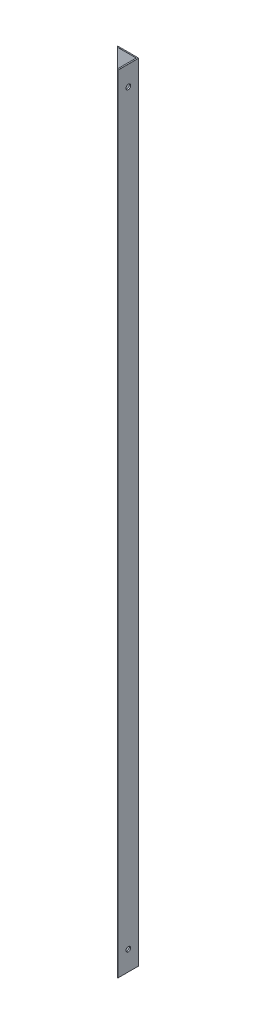
ISO-10303-21;
HEADER;
FILE_DESCRIPTION(('STEP AP214'),'2;1');
FILE_NAME('part.step','',(''),(''),'','','');
FILE_SCHEMA(('AUTOMOTIVE_DESIGN { 1 0 10303 214 1 1 1 1 }'));
ENDSEC;
DATA;
#1=APPLICATION_CONTEXT('core data for automotive mechanical design processes');
#2=APPLICATION_PROTOCOL_DEFINITION('international standard','automotive_design',2000,#1);
#3=PRODUCT_CONTEXT('',#1,'mechanical');
#4=PRODUCT('Part','Part','',(#3));
#5=PRODUCT_RELATED_PRODUCT_CATEGORY('part','',(#4));
#6=PRODUCT_DEFINITION_FORMATION('','',#4);
#7=PRODUCT_DEFINITION_CONTEXT('part definition',#1,'design');
#8=PRODUCT_DEFINITION('design','',#6,#7);
#9=PRODUCT_DEFINITION_SHAPE('','',#8);
#10=(LENGTH_UNIT() NAMED_UNIT(*) SI_UNIT(.MILLI.,.METRE.));
#11=(NAMED_UNIT(*) PLANE_ANGLE_UNIT() SI_UNIT($,.RADIAN.));
#12=(NAMED_UNIT(*) SI_UNIT($,.STERADIAN.) SOLID_ANGLE_UNIT());
#13=UNCERTAINTY_MEASURE_WITH_UNIT(LENGTH_MEASURE(1.E-05),#10,'distance_accuracy_value','');
#14=(GEOMETRIC_REPRESENTATION_CONTEXT(3) GLOBAL_UNCERTAINTY_ASSIGNED_CONTEXT((#13)) GLOBAL_UNIT_ASSIGNED_CONTEXT((#10,
#11,#12)) REPRESENTATION_CONTEXT('',''));
#15=CARTESIAN_POINT('',(0.,0.,0.));
#16=DIRECTION('',(0.,0.,1.));
#17=DIRECTION('',(1.,0.,0.));
#18=AXIS2_PLACEMENT_3D('',#15,#16,#17);
#19=CARTESIAN_POINT('',(23.6850662103019,2000.,46.5553915714054));
#20=DIRECTION('',(0.,-1.,0.));
#21=DIRECTION('',(0.,0.,-1.));
#22=AXIS2_PLACEMENT_3D('',#19,#20,#21);
#23=CYLINDRICAL_SURFACE('',#22,3.44460842859456);
#24=DIRECTION('',(0.,-1.,0.));
#25=VECTOR('',#24,1.);
#26=CARTESIAN_POINT('',(20.2404577817074,2000.,46.5553915714054));
#27=LINE('',#26,#25);
#28=CARTESIAN_POINT('',(20.2404577817074,1999.9,46.5553915714054));
#29=VERTEX_POINT('',#28);
#30=CARTESIAN_POINT('',(20.2404577817074,0.099999999999989,46.5553915714054));
#31=VERTEX_POINT('',#30);
#32=EDGE_CURVE('E277',#29,#31,#27,.T.);
#33=ORIENTED_EDGE('',*,*,#32,.T.);
#34=CARTESIAN_POINT('',(23.6850662103019,0.099999999999989,46.5553915714054));
#35=DIRECTION('',(0.,1.,0.));
#36=DIRECTION('',(0.,0.,1.));
#37=AXIS2_PLACEMENT_3D('',#34,#35,#36);
#38=CIRCLE('',#37,3.44460842859456);
#39=CARTESIAN_POINT('',(23.6850662103019,0.100000000000211,50.));
#40=VERTEX_POINT('',#39);
#41=EDGE_CURVE('E152',#31,#40,#38,.T.);
#42=ORIENTED_EDGE('',*,*,#41,.T.);
#43=DIRECTION('',(0.,-1.,0.));
#44=VECTOR('',#43,1.);
#45=CARTESIAN_POINT('',(23.6850662103019,2000.,50.));
#46=LINE('',#45,#44);
#47=CARTESIAN_POINT('',(23.6850662103019,1999.9,50.));
#48=VERTEX_POINT('',#47);
#49=EDGE_CURVE('E290',#48,#40,#46,.T.);
#50=ORIENTED_EDGE('',*,*,#49,.F.);
#51=CARTESIAN_POINT('',(23.6850662103019,1999.9,46.5553915714054));
#52=DIRECTION('',(0.,1.,0.));
#53=DIRECTION('',(0.,0.,1.));
#54=AXIS2_PLACEMENT_3D('',#51,#52,#53);
#55=CIRCLE('',#54,3.44460842859456);
#56=EDGE_CURVE('E148',#48,#29,#55,.F.);
#57=ORIENTED_EDGE('',*,*,#56,.T.);
#58=EDGE_LOOP('',(#33,#42,#50,#57));
#59=FACE_BOUND('',#58,.T.);
#60=ADVANCED_FACE('F35',(#59),#23,.T.);
#61=CARTESIAN_POINT('',(23.6850662103019,2000.,11.4167963099841));
#62=DIRECTION('',(-1.,0.,0.));
#63=DIRECTION('',(0.,0.,1.));
#64=AXIS2_PLACEMENT_3D('',#61,#62,#63);
#65=PLANE('',#64);
#66=CARTESIAN_POINT('',(23.6850662103019,1949.9,23.5));
#67=DIRECTION('',(1.,0.,0.));
#68=DIRECTION('',(0.,0.,-1.));
#69=AXIS2_PLACEMENT_3D('',#66,#67,#68);
#70=CIRCLE('',#69,6.);
#71=CARTESIAN_POINT('',(23.6850662103019,1949.9,17.5));
#72=VERTEX_POINT('',#71);
#73=EDGE_CURVE('E258',#72,#72,#70,.T.);
#74=ORIENTED_EDGE('',*,*,#73,.F.);
#75=EDGE_LOOP('',(#74));
#76=FACE_BOUND('',#75,.T.);
#77=CARTESIAN_POINT('',(23.6850662103019,50.1000000000002,23.4999999999998));
#78=DIRECTION('',(1.,0.,0.));
#79=DIRECTION('',(0.,0.,-1.));
#80=AXIS2_PLACEMENT_3D('',#77,#78,#79);
#81=CIRCLE('',#80,6.);
#82=CARTESIAN_POINT('',(23.6850662103019,50.1000000000002,17.4999999999998));
#83=VERTEX_POINT('',#82);
#84=EDGE_CURVE('E255',#83,#83,#81,.T.);
#85=ORIENTED_EDGE('',*,*,#84,.F.);
#86=EDGE_LOOP('',(#85));
#87=FACE_BOUND('',#86,.T.);
#88=ORIENTED_EDGE('',*,*,#49,.T.);
#89=DIRECTION('',(0.,0.,-1.));
#90=VECTOR('',#89,1.);
#91=CARTESIAN_POINT('',(23.6850662103019,0.099999999999989,11.4167963099841));
#92=LINE('',#91,#90);
#93=CARTESIAN_POINT('',(23.6850662103019,0.100000000000211,-3.00000000000001));
#94=VERTEX_POINT('',#93);
#95=EDGE_CURVE('E175',#40,#94,#92,.T.);
#96=ORIENTED_EDGE('',*,*,#95,.T.);
#97=DIRECTION('',(0.,-1.,0.));
#98=VECTOR('',#97,1.);
#99=CARTESIAN_POINT('',(23.6850662103019,2000.,-3.00000000000001));
#100=LINE('',#99,#98);
#101=CARTESIAN_POINT('',(23.6850662103019,1999.9,-3.00000000000001));
#102=VERTEX_POINT('',#101);
#103=EDGE_CURVE('E287',#102,#94,#100,.T.);
#104=ORIENTED_EDGE('',*,*,#103,.F.);
#105=DIRECTION('',(0.,0.,-1.));
#106=VECTOR('',#105,1.);
#107=CARTESIAN_POINT('',(23.6850662103019,1999.9,50.));
#108=LINE('',#107,#106);
#109=EDGE_CURVE('E173',#102,#48,#108,.F.);
#110=ORIENTED_EDGE('',*,*,#109,.T.);
#111=EDGE_LOOP('',(#88,#96,#104,#110));
#112=FACE_BOUND('',#111,.T.);
#113=ADVANCED_FACE('F328',(#76,#87,#112),#65,.F.);
#114=CARTESIAN_POINT('',(-61.9284113845546,2000.,-3.));
#115=DIRECTION('',(0.,0.,1.));
#116=DIRECTION('',(1.,0.,0.));
#117=AXIS2_PLACEMENT_3D('',#114,#115,#116);
#118=PLANE('',#117);
#119=CARTESIAN_POINT('',(0.,1950.,-3.));
#120=DIRECTION('',(0.,0.,-1.));
#121=DIRECTION('',(-1.,0.,0.));
#122=AXIS2_PLACEMENT_3D('',#119,#120,#121);
#123=CIRCLE('',#122,6.);
#124=CARTESIAN_POINT('',(-6.,1950.,-3.));
#125=VERTEX_POINT('',#124);
#126=EDGE_CURVE('E271',#125,#125,#123,.T.);
#127=ORIENTED_EDGE('',*,*,#126,.F.);
#128=EDGE_LOOP('',(#127));
#129=FACE_BOUND('',#128,.T.);
#130=CARTESIAN_POINT('',(0.,50.,-3.));
#131=DIRECTION('',(0.,0.,-1.));
#132=DIRECTION('',(-1.,0.,0.));
#133=AXIS2_PLACEMENT_3D('',#130,#131,#132);
#134=CIRCLE('',#133,6.);
#135=CARTESIAN_POINT('',(-6.,50.,-3.));
#136=VERTEX_POINT('',#135);
#137=EDGE_CURVE('E261',#136,#136,#134,.T.);
#138=ORIENTED_EDGE('',*,*,#137,.F.);
#139=EDGE_LOOP('',(#138));
#140=FACE_BOUND('',#139,.T.);
#141=ORIENTED_EDGE('',*,*,#103,.T.);
#142=DIRECTION('',(-1.,0.,0.));
#143=VECTOR('',#142,1.);
#144=CARTESIAN_POINT('',(-61.9284113845546,0.099999999999989,-3.));
#145=LINE('',#144,#143);
#146=CARTESIAN_POINT('',(-29.7595422182926,0.099999999999989,-3.));
#147=VERTEX_POINT('',#146);
#148=EDGE_CURVE('E179',#94,#147,#145,.T.);
#149=ORIENTED_EDGE('',*,*,#148,.T.);
#150=DIRECTION('',(0.,-1.,0.));
#151=VECTOR('',#150,1.);
#152=CARTESIAN_POINT('',(-29.7595422182926,2000.,-3.));
#153=LINE('',#152,#151);
#154=CARTESIAN_POINT('',(-29.7595422182926,1999.9,-3.));
#155=VERTEX_POINT('',#154);
#156=EDGE_CURVE('E131',#155,#147,#153,.T.);
#157=ORIENTED_EDGE('',*,*,#156,.F.);
#158=DIRECTION('',(-1.,0.,0.));
#159=VECTOR('',#158,1.);
#160=CARTESIAN_POINT('',(23.6850662103019,1999.9,-3.00000000000001));
#161=LINE('',#160,#159);
#162=EDGE_CURVE('E177',#155,#102,#161,.F.);
#163=ORIENTED_EDGE('',*,*,#162,.T.);
#164=EDGE_LOOP('',(#141,#149,#157,#163));
#165=FACE_BOUND('',#164,.T.);
#166=ADVANCED_FACE('F200',(#129,#140,#165),#118,.F.);
#167=CARTESIAN_POINT('',(-26.7507357630917,2000.,-3.));
#168=DIRECTION('',(0.,-1.,0.));
#169=DIRECTION('',(0.,0.,-1.));
#170=AXIS2_PLACEMENT_3D('',#167,#168,#169);
#171=CYLINDRICAL_SURFACE('',#170,3.00880645520094);
#172=ORIENTED_EDGE('',*,*,#156,.T.);
#173=CARTESIAN_POINT('',(-29.7595422182926,0.099999999999989,-3.));
#174=CARTESIAN_POINT('',(-29.7595417690738,0.0943742322855582,-3.00000477807954));
#175=CARTESIAN_POINT('',(-29.759542211009,0.0887498913895016,-2.99952554683466));
#176=CARTESIAN_POINT('',(-29.7595415556206,0.0776645970708112,-2.99763432190128));
#177=CARTESIAN_POINT('',(-29.7595404595007,0.0722035193008721,-2.99622305803308));
#178=CARTESIAN_POINT('',(-29.7595334144243,0.061593445610054,-2.99250202831795));
#179=CARTESIAN_POINT('',(-29.7595274631337,0.0564446010693474,-2.99019183060305));
#180=CARTESIAN_POINT('',(-29.7595047610167,0.0466086732196983,-2.98474053455914));
#181=CARTESIAN_POINT('',(-29.7594880120904,0.041921508837429,-2.98159958247301));
#182=CARTESIAN_POINT('',(-29.7594368398036,0.0331412901402215,-2.9745756261875));
#183=CARTESIAN_POINT('',(-29.7594024174324,0.0290482025858148,-2.97069266353288));
#184=CARTESIAN_POINT('',(-29.7593088708123,0.0215712651807125,-2.96229401470441));
#185=CARTESIAN_POINT('',(-29.7592497418476,0.0181875509162628,-2.95777820784642));
#186=CARTESIAN_POINT('',(-29.7591008110204,0.012226495869483,-2.94824350913846));
#187=CARTESIAN_POINT('',(-29.759011009154,0.00964915518607266,-2.94322461722679));
#188=CARTESIAN_POINT('',(-29.7587967740408,0.00537479325981419,-2.93282707832559));
#189=CARTESIAN_POINT('',(-29.7586723608775,0.00367726312827122,-2.9274486413367));
#190=CARTESIAN_POINT('',(-29.758436707348,0.00163115109063416,-2.9183645149583));
#191=CARTESIAN_POINT('',(-29.7583355046517,0.00101980258944746,-2.91471557576013));
#192=CARTESIAN_POINT('',(-29.7581185243371,0.000204279045641968,-2.9073781848153));
#193=CARTESIAN_POINT('',(-29.7580027676939,-4.74984724881859E-07,-2.9036897967845));
#194=CARTESIAN_POINT('',(-29.757879970618,-4.76053352209366E-13,-2.90000000000011));
#195=B_SPLINE_CURVE_WITH_KNOTS('',3,(#173,#174,#175,#176,#177,#178,#179,#180,#181,#182,#183,
#184,#185,#186,#187,#188,#189,#190,#191,#192,#193,#194),.UNSPECIFIED.,.F.,.F.,(4,2,2,2,2,2,2,2,
2,2,4),(0.,0.0168548839564319,0.0336965854615551,0.0505463881075804,0.0673932265496339,
0.0842391220227314,0.101088234410699,0.117937348865586,0.134776706765806,0.145859134003079,
0.156925768590492),.UNSPECIFIED.);
#196=CARTESIAN_POINT('',(-29.757879970618,0.,-2.9));
#197=VERTEX_POINT('',#196);
#198=EDGE_CURVE('E126',#147,#197,#195,.T.);
#199=ORIENTED_EDGE('',*,*,#198,.T.);
#200=CARTESIAN_POINT('',(-26.7507357630917,0.,-3.));
#201=DIRECTION('',(0.,1.,0.));
#202=DIRECTION('',(0.,0.,1.));
#203=AXIS2_PLACEMENT_3D('',#200,#201,#202);
#204=CIRCLE('',#203,3.00880645520094);
#205=CARTESIAN_POINT('',(-27.5525563694987,0.,-0.0999999999999994));
#206=VERTEX_POINT('',#205);
#207=EDGE_CURVE('E129',#197,#206,#204,.T.);
#208=ORIENTED_EDGE('',*,*,#207,.T.);
#209=CARTESIAN_POINT('',(-27.5525563694987,0.,-0.1));
#210=CARTESIAN_POINT('',(-27.5203076627853,4.82061141471723E-05,-0.0910822895298904));
#211=CARTESIAN_POINT('',(-27.4879383642966,0.0011858197783805,-0.0827127946192675));
#212=CARTESIAN_POINT('',(-27.4230643875657,0.00521780892858665,-0.0670832032178255));
#213=CARTESIAN_POINT('',(-27.3905598327654,0.00811083096054839,-0.0598222574070298));
#214=CARTESIAN_POINT('',(-27.3161788572188,0.0162497432691016,-0.0444940294537487));
#215=CARTESIAN_POINT('',(-27.2742764992136,0.0219315875372554,-0.0367884801402077));
#216=CARTESIAN_POINT('',(-27.2039588403571,0.033109375539979,-0.0253850044914544));
#217=CARTESIAN_POINT('',(-27.1755374898798,0.0380780771372102,-0.0211950141097183));
#218=CARTESIAN_POINT('',(-27.1280423677989,0.0473182943384211,-0.0148822389866128));
#219=CARTESIAN_POINT('',(-27.1089413111005,0.0512891722494254,-0.0125308057560604));
#220=CARTESIAN_POINT('',(-27.0771094487125,0.0585858888820321,-0.00891954509728447));
#221=CARTESIAN_POINT('',(-27.064342378261,0.061696667370561,-0.00755451656795268));
#222=CARTESIAN_POINT('',(-27.043110276712,0.0674301696063135,-0.00542038940227326));
#223=CARTESIAN_POINT('',(-27.0346045295302,0.0698795184300798,-0.00460244742618608));
#224=CARTESIAN_POINT('',(-27.0204872950642,0.0744327117638685,-0.00330465387558594));
#225=CARTESIAN_POINT('',(-27.0148326806984,0.0763905645089115,-0.00280125104263516));
#226=CARTESIAN_POINT('',(-27.0054763666386,0.0800693782239627,-0.0019943354412549));
#227=CARTESIAN_POINT('',(-27.0017281682564,0.0816660256676913,-0.00167836238329875));
#228=CARTESIAN_POINT('',(-26.995552020851,0.0847019113390952,-0.00116895798130572));
#229=CARTESIAN_POINT('',(-26.9930761122526,0.0860355848536224,-0.000967985333301237));
#230=CARTESIAN_POINT('',(-26.9894540928618,0.0883462711942806,-0.000678167068089319));
#231=CARTESIAN_POINT('',(-26.9882290628561,0.0891970642298744,-0.000580951763594698));
#232=CARTESIAN_POINT('',(-26.9858954996035,0.0910477470256331,-0.000397107331810574));
#233=CARTESIAN_POINT('',(-26.9847864483644,0.0920469209490527,-0.000310430825599701));
#234=CARTESIAN_POINT('',(-26.9834085791875,0.0936101828216562,-0.000203371666077902));
#235=CARTESIAN_POINT('',(-26.9830331889205,0.0940782611395039,-0.00017428627737595));
#236=CARTESIAN_POINT('',(-26.9823434814029,0.0950584744830558,-0.000120957930055414));
#237=CARTESIAN_POINT('',(-26.9820291188971,0.0955705764531575,-9.67113828047918E-05));
#238=CARTESIAN_POINT('',(-26.9815391132133,0.0965388487302593,-5.89759626820503E-05));
#239=CARTESIAN_POINT('',(-26.9813484776558,0.0969872711438747,-4.43196984261674E-05));
#240=CARTESIAN_POINT('',(-26.9810424904108,0.0979089073561162,-2.08133593743876E-05));
#241=CARTESIAN_POINT('',(-26.9809269113784,0.0983820415543215,-1.1945750415102E-05));
#242=CARTESIAN_POINT('',(-26.9808277077937,0.0990496861596022,-4.33625859717711E-06));
#243=CARTESIAN_POINT('',(-26.9808065717659,0.0992389983955378,-2.7153151412495E-06));
#244=CARTESIAN_POINT('',(-26.9807782835699,0.0996188411405958,-5.46037763313421E-07));
#245=CARTESIAN_POINT('',(-26.9807711441305,0.099809372600704,1.31981672983211E-09));
#246=CARTESIAN_POINT('',(-26.9807711622346,0.0999999999999887,0.));
#247=B_SPLINE_CURVE_WITH_KNOTS('',3,(#209,#210,#211,#212,#213,#214,#215,#216,#217,#218,#219,
#220,#221,#222,#223,#224,#225,#226,#227,#228,#229,#230,#231,#232,#233,#234,#235,#236,#237,#238,
#239,#240,#241,#242,#243,#244,#245,#246),.UNSPECIFIED.,.F.,.F.,(4,2,2,2,2,2,2,2,2,2,2,2,2,2,2,2,
2,2,4),(0.,0.100312587741493,0.200547930630939,0.329403475384653,0.416842333507329,
0.475780712408881,0.515404449881789,0.542062609523358,0.560066107744915,0.572314961980908,
0.580753108945507,0.58523246800094,0.589690879922282,0.591489730785395,0.593287242567355,
0.594744682930938,0.596197687884476,0.596768733618089,0.597340298432562),.UNSPECIFIED.);
#248=CARTESIAN_POINT('',(-26.9807711622346,0.099999999999989,0.));
#249=VERTEX_POINT('',#248);
#250=EDGE_CURVE('E53',#206,#249,#247,.T.);
#251=ORIENTED_EDGE('',*,*,#250,.T.);
#252=DIRECTION('',(0.,-1.,0.));
#253=VECTOR('',#252,1.);
#254=CARTESIAN_POINT('',(-26.9807711622346,2000.,0.));
#255=LINE('',#254,#253);
#256=CARTESIAN_POINT('',(-26.9807711622346,1999.9,0.));
#257=VERTEX_POINT('',#256);
#258=EDGE_CURVE('E284',#257,#249,#255,.T.);
#259=ORIENTED_EDGE('',*,*,#258,.F.);
#260=CARTESIAN_POINT('',(-26.9807711622346,1999.9,0.));
#261=CARTESIAN_POINT('',(-26.980769718853,1999.90047411996,1.07706010250674E-07));
#262=CARTESIAN_POINT('',(-26.9808150759493,1999.900946214,-3.36707263194134E-06));
#263=CARTESIAN_POINT('',(-26.9809856270672,1999.90186925778,-1.64506023731021E-05));
#264=CARTESIAN_POINT('',(-26.9811097156725,1999.90232040891,-2.59744248195875E-05));
#265=CARTESIAN_POINT('',(-26.9814773038131,1999.90334489798,-5.42225704590842E-05));
#266=CARTESIAN_POINT('',(-26.981746864124,1999.90390861751,-7.49590034163623E-05));
#267=CARTESIAN_POINT('',(-26.9823708196168,1999.90498930504,-0.000123071566116954));
#268=CARTESIAN_POINT('',(-26.9827257490514,1999.90550594919,-0.000150489524663362));
#269=CARTESIAN_POINT('',(-26.9838283728161,1999.90692810606,-0.000235904504029261));
#270=CARTESIAN_POINT('',(-26.9846474095329,1999.90777700715,-0.000299621819820901));
#271=CARTESIAN_POINT('',(-26.9863875922367,1999.90935875731,-0.000435816415633031));
#272=CARTESIAN_POINT('',(-26.9873089852085,1999.91009131483,-0.000508314924379571));
#273=CARTESIAN_POINT('',(-26.9917419728463,1999.91334007023,-0.000859413245184962));
#274=CARTESIAN_POINT('',(-26.995584963336,1999.91538171858,-0.00117023157579726));
#275=CARTESIAN_POINT('',(-27.0034442263455,1999.91908500171,-0.0018220545138436));
#276=CARTESIAN_POINT('',(-27.0074615639862,1999.92074373624,-0.00216326400316481));
#277=CARTESIAN_POINT('',(-27.0195300753792,1999.92534888881,-0.00321341182106582));
#278=CARTESIAN_POINT('',(-27.0277034181014,1999.92797814644,-0.00395716252718484));
#279=CARTESIAN_POINT('',(-27.0441533068312,1999.93286801619,-0.00552317162270239));
#280=CARTESIAN_POINT('',(-27.0524300042635,1999.93512799603,-0.00634556092300244));
#281=CARTESIAN_POINT('',(-27.0772788865334,1999.94154478313,-0.00891961372371039));
#282=CARTESIAN_POINT('',(-27.0939296201248,1999.94535744005,-0.0107833343155886));
#283=CARTESIAN_POINT('',(-27.1475284830615,1999.95686207189,-0.0172403461491833));
#284=CARTESIAN_POINT('',(-27.1845959835226,1999.9636493008,-0.022402207861905));
#285=CARTESIAN_POINT('',(-27.2587743168544,1999.97572305822,-0.0341567145451804));
#286=CARTESIAN_POINT('',(-27.2958851602234,1999.98100834219,-0.040750538134858));
#287=CARTESIAN_POINT('',(-27.3697268431524,1999.98986478272,-0.0553149938209546));
#288=CARTESIAN_POINT('',(-27.4064582793594,1999.99344980808,-0.0632737390058482));
#289=CARTESIAN_POINT('',(-27.4613952290086,1999.99724609407,-0.0762638207480191));
#290=CARTESIAN_POINT('',(-27.4796724552924,1999.9982478827,-0.0807668572403908));
#291=CARTESIAN_POINT('',(-27.5161660262791,1999.99962218123,-0.0901223578962783));
#292=CARTESIAN_POINT('',(-27.5343823519674,1999.99999451012,-0.0949749221491903));
#293=CARTESIAN_POINT('',(-27.5525563694986,2000.,-0.0999999999999916));
#294=B_SPLINE_CURVE_WITH_KNOTS('',3,(#260,#261,#262,#263,#264,#265,#266,#267,#268,#269,#270,
#271,#272,#273,#274,#275,#276,#277,#278,#279,#280,#281,#282,#283,#284,#285,#286,#287,#288,#289,
#290,#291,#292,#293),.UNSPECIFIED.,.F.,.F.,(4,2,2,2,2,2,2,2,2,2,2,2,2,2,2,2,4),(0.,
0.0014169191978107,0.00281437177372994,0.00467935382490117,0.00655632563251038,
0.0100804293086168,0.0136132293200908,0.0266026849372312,0.039687513646267,0.0655018868828782,
0.0913600077339763,0.142887748523618,0.256923757839524,0.371053986072941,0.48423653776485,
0.540775705079696,0.597331127591749),.UNSPECIFIED.);
#295=CARTESIAN_POINT('',(-27.5525563694987,2000.,-0.0999999999999994));
#296=VERTEX_POINT('',#295);
#297=EDGE_CURVE('E181',#257,#296,#294,.T.);
#298=ORIENTED_EDGE('',*,*,#297,.T.);
#299=CARTESIAN_POINT('',(-26.7507357630917,2000.,-3.));
#300=DIRECTION('',(0.,1.,0.));
#301=DIRECTION('',(0.,0.,1.));
#302=AXIS2_PLACEMENT_3D('',#299,#300,#301);
#303=CIRCLE('',#302,3.00880645520094);
#304=CARTESIAN_POINT('',(-29.757879970618,2000.,-2.9));
#305=VERTEX_POINT('',#304);
#306=EDGE_CURVE('E142',#305,#296,#303,.T.);
#307=ORIENTED_EDGE('',*,*,#306,.F.);
#308=CARTESIAN_POINT('',(-29.757879970618,2000.,-2.9));
#309=CARTESIAN_POINT('',(-29.758067546618,2000.00000479851,-2.90562238458636));
#310=CARTESIAN_POINT('',(-29.7582381107428,1999.99952611484,-2.9112439731164));
#311=CARTESIAN_POINT('',(-29.7585443660695,1999.9976365815,-2.9223249350217));
#312=CARTESIAN_POINT('',(-29.7586800842176,1999.99622645515,-2.92778443083567));
#313=CARTESIAN_POINT('',(-29.758916150409,1999.99250781036,-2.93839243143987));
#314=CARTESIAN_POINT('',(-29.7590164808049,1999.99019884489,-2.94354078000837));
#315=CARTESIAN_POINT('',(-29.7591849766835,1999.98474990615,-2.95337637284387));
#316=CARTESIAN_POINT('',(-29.7592531480078,1999.98161008398,-2.95806370073204));
#317=CARTESIAN_POINT('',(-29.7593627366915,1999.97458901143,-2.96684363528814));
#318=CARTESIAN_POINT('',(-29.7594041620511,1999.97070798323,-2.97093641951363));
#319=CARTESIAN_POINT('',(-29.7594671104075,1999.96231309933,-2.97841347701758));
#320=CARTESIAN_POINT('',(-29.759488629466,1999.95779911862,-2.98179760999899));
#321=CARTESIAN_POINT('',(-29.7595188100709,1999.94826613169,-2.9877611193224));
#322=CARTESIAN_POINT('',(-29.7595274674775,1999.94324696342,-2.99034023635088));
#323=CARTESIAN_POINT('',(-29.7595381699015,1999.93284790167,-2.99461806044434));
#324=CARTESIAN_POINT('',(-29.7595402187778,1999.92746822057,-2.99631728082549));
#325=CARTESIAN_POINT('',(-29.7595418841662,1999.91837985557,-2.99836608050016));
#326=CARTESIAN_POINT('',(-29.7595420925527,1999.91472824005,-2.99897842578769));
#327=CARTESIAN_POINT('',(-29.7595422191827,1999.90738492587,-2.99979533473241));
#328=CARTESIAN_POINT('',(-29.7595421378366,1999.90369329129,-3.00000047457001));
#329=CARTESIAN_POINT('',(-29.759542218293,1999.9,-3.00000000000048));
#330=B_SPLINE_CURVE_WITH_KNOTS('',3,(#308,#309,#310,#311,#312,#313,#314,#315,#316,#317,#318,
#319,#320,#321,#322,#323,#324,#325,#326,#327,#328,#329),.UNSPECIFIED.,.F.,.F.,(4,2,2,2,2,2,2,2,
2,2,4),(0.,0.0168542318005121,0.0336953907628248,0.0505449363143928,0.0673914199920905,
0.0842328621609756,0.101077635412162,0.117927829152834,0.134768181682093,0.145854836284214,
0.156925792472826),.UNSPECIFIED.);
#331=EDGE_CURVE('E187',#305,#155,#330,.T.);
#332=ORIENTED_EDGE('',*,*,#331,.T.);
#333=EDGE_LOOP('',(#172,#199,#208,#251,#259,#298,#307,#332));
#334=FACE_BOUND('',#333,.T.);
#335=ADVANCED_FACE('F128',(#334),#171,.T.);
#336=CARTESIAN_POINT('',(-61.9284113845546,2000.,0.));
#337=DIRECTION('',(0.,0.,-1.));
#338=DIRECTION('',(-1.,0.,0.));
#339=AXIS2_PLACEMENT_3D('',#336,#337,#338);
#340=PLANE('',#339);
#341=CARTESIAN_POINT('',(0.,1950.,0.));
#342=DIRECTION('',(0.,0.,-1.));
#343=DIRECTION('',(-1.,0.,0.));
#344=AXIS2_PLACEMENT_3D('',#341,#342,#343);
#345=CIRCLE('',#344,6.);
#346=CARTESIAN_POINT('',(-6.,1950.,0.));
#347=VERTEX_POINT('',#346);
#348=EDGE_CURVE('E40',#347,#347,#345,.T.);
#349=ORIENTED_EDGE('',*,*,#348,.T.);
#350=EDGE_LOOP('',(#349));
#351=FACE_BOUND('',#350,.T.);
#352=CARTESIAN_POINT('',(0.,50.,0.));
#353=DIRECTION('',(0.,0.,-1.));
#354=DIRECTION('',(-1.,0.,0.));
#355=AXIS2_PLACEMENT_3D('',#352,#353,#354);
#356=CIRCLE('',#355,6.);
#357=CARTESIAN_POINT('',(-6.,50.,0.));
#358=VERTEX_POINT('',#357);
#359=EDGE_CURVE('E259',#358,#358,#356,.T.);
#360=ORIENTED_EDGE('',*,*,#359,.T.);
#361=EDGE_LOOP('',(#360));
#362=FACE_BOUND('',#361,.T.);
#363=ORIENTED_EDGE('',*,*,#258,.T.);
#364=DIRECTION('',(1.,0.,0.));
#365=VECTOR('',#364,1.);
#366=CARTESIAN_POINT('',(-61.9284113845546,0.099999999999989,0.));
#367=LINE('',#366,#365);
#368=CARTESIAN_POINT('',(20.2404577817074,0.100000000000211,0.));
#369=VERTEX_POINT('',#368);
#370=EDGE_CURVE('E11',#249,#369,#367,.T.);
#371=ORIENTED_EDGE('',*,*,#370,.T.);
#372=DIRECTION('',(0.,-1.,0.));
#373=VECTOR('',#372,1.);
#374=CARTESIAN_POINT('',(20.2404577817074,2000.,0.));
#375=LINE('',#374,#373);
#376=CARTESIAN_POINT('',(20.2404577817074,1999.9,0.));
#377=VERTEX_POINT('',#376);
#378=EDGE_CURVE('E281',#377,#369,#375,.T.);
#379=ORIENTED_EDGE('',*,*,#378,.F.);
#380=DIRECTION('',(1.,0.,0.));
#381=VECTOR('',#380,1.);
#382=CARTESIAN_POINT('',(-26.9807711622346,1999.9,0.));
#383=LINE('',#382,#381);
#384=EDGE_CURVE('E45',#377,#257,#383,.F.);
#385=ORIENTED_EDGE('',*,*,#384,.T.);
#386=EDGE_LOOP('',(#363,#371,#379,#385));
#387=FACE_BOUND('',#386,.T.);
#388=ADVANCED_FACE('F199',(#351,#362,#387),#340,.F.);
#389=CARTESIAN_POINT('',(20.2404577817074,2000.,11.4167963099841));
#390=DIRECTION('',(1.,0.,0.));
#391=DIRECTION('',(0.,0.,-1.));
#392=AXIS2_PLACEMENT_3D('',#389,#390,#391);
#393=PLANE('',#392);
#394=CARTESIAN_POINT('',(20.2404577817074,1949.9,23.5));
#395=DIRECTION('',(1.,0.,0.));
#396=DIRECTION('',(0.,0.,-1.));
#397=AXIS2_PLACEMENT_3D('',#394,#395,#396);
#398=CIRCLE('',#397,6.);
#399=CARTESIAN_POINT('',(20.2404577817074,1949.9,17.5));
#400=VERTEX_POINT('',#399);
#401=EDGE_CURVE('E256',#400,#400,#398,.T.);
#402=ORIENTED_EDGE('',*,*,#401,.T.);
#403=EDGE_LOOP('',(#402));
#404=FACE_BOUND('',#403,.T.);
#405=CARTESIAN_POINT('',(20.2404577817074,50.1000000000002,23.4999999999998));
#406=DIRECTION('',(1.,0.,0.));
#407=DIRECTION('',(0.,0.,-1.));
#408=AXIS2_PLACEMENT_3D('',#405,#406,#407);
#409=CIRCLE('',#408,6.);
#410=CARTESIAN_POINT('',(20.2404577817074,50.1000000000002,17.4999999999998));
#411=VERTEX_POINT('',#410);
#412=EDGE_CURVE('E252',#411,#411,#409,.T.);
#413=ORIENTED_EDGE('',*,*,#412,.T.);
#414=EDGE_LOOP('',(#413));
#415=FACE_BOUND('',#414,.T.);
#416=ORIENTED_EDGE('',*,*,#378,.T.);
#417=DIRECTION('',(0.,0.,1.));
#418=VECTOR('',#417,1.);
#419=CARTESIAN_POINT('',(20.2404577817074,0.099999999999989,11.4167963099841));
#420=LINE('',#419,#418);
#421=EDGE_CURVE('E171',#369,#31,#420,.T.);
#422=ORIENTED_EDGE('',*,*,#421,.T.);
#423=ORIENTED_EDGE('',*,*,#32,.F.);
#424=DIRECTION('',(0.,0.,1.));
#425=VECTOR('',#424,1.);
#426=CARTESIAN_POINT('',(20.2404577817074,1999.9,0.));
#427=LINE('',#426,#425);
#428=EDGE_CURVE('E169',#29,#377,#427,.F.);
#429=ORIENTED_EDGE('',*,*,#428,.T.);
#430=EDGE_LOOP('',(#416,#422,#423,#429));
#431=FACE_BOUND('',#430,.T.);
#432=ADVANCED_FACE('F338',(#404,#415,#431),#393,.F.);
#433=CARTESIAN_POINT('',(-61.9284113845546,2000.,11.4167963099841));
#434=DIRECTION('',(0.,1.,0.));
#435=DIRECTION('',(0.,0.,1.));
#436=AXIS2_PLACEMENT_3D('',#433,#434,#435);
#437=PLANE('',#436);
#438=DIRECTION('',(0.,0.,-1.));
#439=VECTOR('',#438,1.);
#440=CARTESIAN_POINT('',(23.5850662103019,2000.,-3.00000000000001));
#441=LINE('',#440,#439);
#442=CARTESIAN_POINT('',(23.5850662103019,2000.,49.8985047224408));
#443=VERTEX_POINT('',#442);
#444=CARTESIAN_POINT('',(23.5850662103019,2000.,-2.90000000000001));
#445=VERTEX_POINT('',#444);
#446=EDGE_CURVE('E165',#443,#445,#441,.T.);
#447=ORIENTED_EDGE('',*,*,#446,.T.);
#448=DIRECTION('',(-1.,0.,0.));
#449=VECTOR('',#448,1.);
#450=CARTESIAN_POINT('',(-29.7595422182926,2000.,-2.9));
#451=LINE('',#450,#449);
#452=EDGE_CURVE('E167',#445,#305,#451,.T.);
#453=ORIENTED_EDGE('',*,*,#452,.T.);
#454=ORIENTED_EDGE('',*,*,#306,.T.);
#455=DIRECTION('',(1.,0.,0.));
#456=VECTOR('',#455,1.);
#457=CARTESIAN_POINT('',(20.2404577817074,2000.,-0.0999999999999994));
#458=LINE('',#457,#456);
#459=CARTESIAN_POINT('',(20.3404577817074,2000.,-0.0999999999999994));
#460=VERTEX_POINT('',#459);
#461=EDGE_CURVE('E159',#296,#460,#458,.T.);
#462=ORIENTED_EDGE('',*,*,#461,.T.);
#463=DIRECTION('',(0.,0.,1.));
#464=VECTOR('',#463,1.);
#465=CARTESIAN_POINT('',(20.3404577817074,2000.,46.5553915714054));
#466=LINE('',#465,#464);
#467=CARTESIAN_POINT('',(20.3404577817074,2000.,46.5553915714054));
#468=VERTEX_POINT('',#467);
#469=EDGE_CURVE('E161',#460,#468,#466,.T.);
#470=ORIENTED_EDGE('',*,*,#469,.T.);
#471=CARTESIAN_POINT('',(23.6850662103019,2000.,46.5553915714054));
#472=DIRECTION('',(0.,1.,0.));
#473=DIRECTION('',(0.,0.,1.));
#474=AXIS2_PLACEMENT_3D('',#471,#472,#473);
#475=CIRCLE('',#474,3.34460842859456);
#476=EDGE_CURVE('E163',#468,#443,#475,.T.);
#477=ORIENTED_EDGE('',*,*,#476,.T.);
#478=EDGE_LOOP('',(#447,#453,#454,#462,#470,#477));
#479=FACE_BOUND('',#478,.T.);
#480=ADVANCED_FACE('F349',(#479),#437,.T.);
#481=CARTESIAN_POINT('',(-61.9284113845546,0.,11.4167963099841));
#482=DIRECTION('',(0.,1.,0.));
#483=DIRECTION('',(0.,0.,1.));
#484=AXIS2_PLACEMENT_3D('',#481,#482,#483);
#485=PLANE('',#484);
#486=ORIENTED_EDGE('',*,*,#207,.F.);
#487=DIRECTION('',(-1.,0.,0.));
#488=VECTOR('',#487,1.);
#489=CARTESIAN_POINT('',(-61.9284113845546,0.,-2.89999999999999));
#490=LINE('',#489,#488);
#491=CARTESIAN_POINT('',(23.5850662103019,0.,-2.90000000000001));
#492=VERTEX_POINT('',#491);
#493=EDGE_CURVE('E138',#197,#492,#490,.F.);
#494=ORIENTED_EDGE('',*,*,#493,.T.);
#495=DIRECTION('',(0.,0.,-1.));
#496=VECTOR('',#495,1.);
#497=CARTESIAN_POINT('',(23.5850662103019,0.,11.4167963099841));
#498=LINE('',#497,#496);
#499=CARTESIAN_POINT('',(23.5850662103019,0.,49.8985047224408));
#500=VERTEX_POINT('',#499);
#501=EDGE_CURVE('E149',#492,#500,#498,.F.);
#502=ORIENTED_EDGE('',*,*,#501,.T.);
#503=CARTESIAN_POINT('',(23.6850662103019,0.,46.5553915714054));
#504=DIRECTION('',(0.,1.,0.));
#505=DIRECTION('',(0.,0.,1.));
#506=AXIS2_PLACEMENT_3D('',#503,#504,#505);
#507=CIRCLE('',#506,3.34460842859456);
#508=CARTESIAN_POINT('',(20.3404577817074,0.,46.5553915714054));
#509=VERTEX_POINT('',#508);
#510=EDGE_CURVE('E154',#500,#509,#507,.F.);
#511=ORIENTED_EDGE('',*,*,#510,.T.);
#512=DIRECTION('',(0.,0.,1.));
#513=VECTOR('',#512,1.);
#514=CARTESIAN_POINT('',(20.3404577817074,0.,11.4167963099841));
#515=LINE('',#514,#513);
#516=CARTESIAN_POINT('',(20.3404577817074,0.,-0.1));
#517=VERTEX_POINT('',#516);
#518=EDGE_CURVE('E294',#509,#517,#515,.F.);
#519=ORIENTED_EDGE('',*,*,#518,.T.);
#520=DIRECTION('',(1.,0.,0.));
#521=VECTOR('',#520,1.);
#522=CARTESIAN_POINT('',(-61.9284113845546,0.,-0.0999999999999994));
#523=LINE('',#522,#521);
#524=EDGE_CURVE('E141',#517,#206,#523,.F.);
#525=ORIENTED_EDGE('',*,*,#524,.T.);
#526=EDGE_LOOP('',(#486,#494,#502,#511,#519,#525));
#527=FACE_BOUND('',#526,.T.);
#528=ADVANCED_FACE('F137',(#527),#485,.F.);
#529=CARTESIAN_POINT('',(-61.9284113845546,0.099999999999989,-2.9));
#530=DIRECTION('',(-1.,0.,0.));
#531=DIRECTION('',(0.,0.,1.));
#532=AXIS2_PLACEMENT_3D('',#529,#530,#531);
#533=CYLINDRICAL_SURFACE('',#532,0.1);
#534=ORIENTED_EDGE('',*,*,#198,.F.);
#535=ORIENTED_EDGE('',*,*,#148,.F.);
#536=CARTESIAN_POINT('',(23.5850662103019,0.099999999999989,-2.9));
#537=DIRECTION('',(-0.707106781186548,0.,-0.707106781186547));
#538=DIRECTION('',(-0.707106781186547,0.,0.707106781186548));
#539=AXIS2_PLACEMENT_3D('',#536,#537,#538);
#540=ELLIPSE('',#539,0.14142135623731,0.1);
#541=EDGE_CURVE('E143',#492,#94,#540,.F.);
#542=ORIENTED_EDGE('',*,*,#541,.F.);
#543=ORIENTED_EDGE('',*,*,#493,.F.);
#544=EDGE_LOOP('',(#534,#535,#542,#543));
#545=FACE_BOUND('',#544,.T.);
#546=ADVANCED_FACE('F145',(#545),#533,.T.);
#547=CARTESIAN_POINT('',(-61.9284113845546,0.099999999999989,-0.1));
#548=DIRECTION('',(1.,0.,0.));
#549=DIRECTION('',(0.,0.,-1.));
#550=AXIS2_PLACEMENT_3D('',#547,#548,#549);
#551=CYLINDRICAL_SURFACE('',#550,0.1);
#552=ORIENTED_EDGE('',*,*,#250,.F.);
#553=ORIENTED_EDGE('',*,*,#524,.F.);
#554=CARTESIAN_POINT('',(20.3404577817074,0.099999999999989,-0.0999999999999997));
#555=DIRECTION('',(0.707106781186547,0.,0.707106781186547));
#556=DIRECTION('',(-0.707106781186547,0.,0.707106781186548));
#557=AXIS2_PLACEMENT_3D('',#554,#555,#556);
#558=ELLIPSE('',#557,0.14142135623731,0.1);
#559=EDGE_CURVE('E310',#369,#517,#558,.T.);
#560=ORIENTED_EDGE('',*,*,#559,.F.);
#561=ORIENTED_EDGE('',*,*,#370,.F.);
#562=EDGE_LOOP('',(#552,#553,#560,#561));
#563=FACE_BOUND('',#562,.T.);
#564=ADVANCED_FACE('F215',(#563),#551,.T.);
#565=CARTESIAN_POINT('',(23.5850662103019,0.099999999999989,11.4167963099841));
#566=DIRECTION('',(0.,0.,-1.));
#567=DIRECTION('',(-1.,0.,0.));
#568=AXIS2_PLACEMENT_3D('',#565,#566,#567);
#569=CYLINDRICAL_SURFACE('',#568,0.1);
#570=ORIENTED_EDGE('',*,*,#541,.T.);
#571=ORIENTED_EDGE('',*,*,#95,.F.);
#572=CARTESIAN_POINT('',(23.6850662103019,0.100000000000211,50.));
#573=CARTESIAN_POINT('',(23.6850737853099,0.095516332411194,50.0000074404782));
#574=CARTESIAN_POINT('',(23.6847651929353,0.0910438892683753,49.9996989866543));
#575=CARTESIAN_POINT('',(23.6835815389205,0.0822897356164736,49.998515093005));
#576=CARTESIAN_POINT('',(23.6827113750176,0.0780067149363257,49.9976445553536));
#577=CARTESIAN_POINT('',(23.6804714693005,0.0697292129998,49.9954023596237));
#578=CARTESIAN_POINT('',(23.6791030771198,0.065733986842553,49.9940320553293));
#579=CARTESIAN_POINT('',(23.6759507824009,0.0580816213485022,49.9908728460517));
#580=CARTESIAN_POINT('',(23.6741659581165,0.0544252575197937,49.9890830124256));
#581=CARTESIAN_POINT('',(23.6694741775736,0.046087708299937,49.9843736109063));
#582=CARTESIAN_POINT('',(23.6664053823228,0.0415904178886714,49.9812899481921));
#583=CARTESIAN_POINT('',(23.6598054657588,0.0333514961868993,49.974647570541));
#584=CARTESIAN_POINT('',(23.6562734687123,0.0296113312771703,49.9710879555088));
#585=CARTESIAN_POINT('',(23.6474407930193,0.0215271318183551,49.9621707467186));
#586=CARTESIAN_POINT('',(23.6419898803967,0.0175219194626504,49.9566556757456));
#587=CARTESIAN_POINT('',(23.6307294243296,0.0107925209473446,49.9452325867436));
#588=CARTESIAN_POINT('',(23.6249194568712,0.00806988341254297,49.9393241034649));
#589=CARTESIAN_POINT('',(23.6136808438056,0.00401385420796254,49.9278636035209));
#590=CARTESIAN_POINT('',(23.6082694318121,0.00257183914218225,49.9223321320918));
#591=CARTESIAN_POINT('',(23.5973888612956,0.000608668526148528,49.9111820809186));
#592=CARTESIAN_POINT('',(23.5919198345832,8.57387276081316E-05,49.9055636901776));
#593=CARTESIAN_POINT('',(23.5859950559152,3.23963987653142E-06,49.8994616651863));
#594=CARTESIAN_POINT('',(23.5855305881652,5.86896526092473E-09,49.8989831992449));
#595=CARTESIAN_POINT('',(23.5850662103019,0.,49.8985047224408));
#596=B_SPLINE_CURVE_WITH_KNOTS('',3,(#572,#573,#574,#575,#576,#577,#578,#579,#580,#581,#582,
#583,#584,#585,#586,#587,#588,#589,#590,#591,#592,#593,#594,#595),.UNSPECIFIED.,.F.,.F.,(4,2,2,
2,2,2,2,2,2,2,2,4),(0.,0.0134120225945743,0.0267086249033232,0.0399694732651411,
0.0532599569033283,0.0719276793947787,0.0906312182265179,0.116673050290131,0.14274624606631,
0.16630594183799,0.189820106629889,0.191820577418145),.UNSPECIFIED.);
#597=EDGE_CURVE('E303',#500,#40,#596,.F.);
#598=ORIENTED_EDGE('',*,*,#597,.F.);
#599=ORIENTED_EDGE('',*,*,#501,.F.);
#600=EDGE_LOOP('',(#570,#571,#598,#599));
#601=FACE_BOUND('',#600,.T.);
#602=ADVANCED_FACE('F219',(#601),#569,.T.);
#603=CARTESIAN_POINT('',(20.3404577817074,0.099999999999989,11.4167963099841));
#604=DIRECTION('',(0.,0.,1.));
#605=DIRECTION('',(1.,0.,0.));
#606=AXIS2_PLACEMENT_3D('',#603,#604,#605);
#607=CYLINDRICAL_SURFACE('',#606,0.1);
#608=ORIENTED_EDGE('',*,*,#559,.T.);
#609=ORIENTED_EDGE('',*,*,#518,.F.);
#610=CARTESIAN_POINT('',(20.3404577817074,0.099999999999989,46.5553915714054));
#611=DIRECTION('',(0.,0.,1.));
#612=DIRECTION('',(1.,0.,0.));
#613=AXIS2_PLACEMENT_3D('',#610,#611,#612);
#614=CIRCLE('',#613,0.1);
#615=EDGE_CURVE('E251',#31,#509,#614,.T.);
#616=ORIENTED_EDGE('',*,*,#615,.F.);
#617=ORIENTED_EDGE('',*,*,#421,.F.);
#618=EDGE_LOOP('',(#608,#609,#616,#617));
#619=FACE_BOUND('',#618,.T.);
#620=ADVANCED_FACE('F221',(#619),#607,.T.);
#621=CARTESIAN_POINT('',(23.6850662103019,0.099999999999989,46.5553915714054));
#622=DIRECTION('',(0.,1.,0.));
#623=DIRECTION('',(0.,0.,1.));
#624=AXIS2_PLACEMENT_3D('',#621,#622,#623);
#625=TOROIDAL_SURFACE('',#624,3.34460842859456,0.1);
#626=ORIENTED_EDGE('',*,*,#597,.T.);
#627=ORIENTED_EDGE('',*,*,#41,.F.);
#628=ORIENTED_EDGE('',*,*,#615,.T.);
#629=ORIENTED_EDGE('',*,*,#510,.F.);
#630=EDGE_LOOP('',(#626,#627,#628,#629));
#631=FACE_BOUND('',#630,.T.);
#632=ADVANCED_FACE('F301',(#631),#625,.T.);
#633=CARTESIAN_POINT('',(-61.9284113845546,1999.9,-2.9));
#634=DIRECTION('',(1.,0.,0.));
#635=DIRECTION('',(0.,0.,-1.));
#636=AXIS2_PLACEMENT_3D('',#633,#634,#635);
#637=CYLINDRICAL_SURFACE('',#636,0.1);
#638=ORIENTED_EDGE('',*,*,#331,.F.);
#639=ORIENTED_EDGE('',*,*,#452,.F.);
#640=CARTESIAN_POINT('',(23.5850662103019,1999.9,-2.90000000000001));
#641=DIRECTION('',(0.707106781186548,0.,0.707106781186547));
#642=DIRECTION('',(0.707106781186547,0.,-0.707106781186548));
#643=AXIS2_PLACEMENT_3D('',#640,#641,#642);
#644=ELLIPSE('',#643,0.14142135623731,0.1);
#645=EDGE_CURVE('E248',#102,#445,#644,.T.);
#646=ORIENTED_EDGE('',*,*,#645,.F.);
#647=ORIENTED_EDGE('',*,*,#162,.F.);
#648=EDGE_LOOP('',(#638,#639,#646,#647));
#649=FACE_BOUND('',#648,.T.);
#650=ADVANCED_FACE('F37',(#649),#637,.T.);
#651=CARTESIAN_POINT('',(-61.9284113845546,1999.9,-0.0999999999999994));
#652=DIRECTION('',(-1.,0.,0.));
#653=DIRECTION('',(0.,0.,1.));
#654=AXIS2_PLACEMENT_3D('',#651,#652,#653);
#655=CYLINDRICAL_SURFACE('',#654,0.1);
#656=ORIENTED_EDGE('',*,*,#297,.F.);
#657=ORIENTED_EDGE('',*,*,#384,.F.);
#658=CARTESIAN_POINT('',(20.3404577817074,1999.9,-0.0999999999999994));
#659=DIRECTION('',(-0.707106781186547,0.,-0.707106781186547));
#660=DIRECTION('',(0.707106781186547,0.,-0.707106781186548));
#661=AXIS2_PLACEMENT_3D('',#658,#659,#660);
#662=ELLIPSE('',#661,0.14142135623731,0.1);
#663=EDGE_CURVE('E243',#460,#377,#662,.F.);
#664=ORIENTED_EDGE('',*,*,#663,.F.);
#665=ORIENTED_EDGE('',*,*,#461,.F.);
#666=EDGE_LOOP('',(#656,#657,#664,#665));
#667=FACE_BOUND('',#666,.T.);
#668=ADVANCED_FACE('F192',(#667),#655,.T.);
#669=CARTESIAN_POINT('',(23.5850662103019,1999.9,11.4167963099841));
#670=DIRECTION('',(0.,0.,1.));
#671=DIRECTION('',(1.,0.,0.));
#672=AXIS2_PLACEMENT_3D('',#669,#670,#671);
#673=CYLINDRICAL_SURFACE('',#672,0.1);
#674=ORIENTED_EDGE('',*,*,#645,.T.);
#675=ORIENTED_EDGE('',*,*,#446,.F.);
#676=CARTESIAN_POINT('',(23.6850662103019,1999.9,50.));
#677=CARTESIAN_POINT('',(23.6850737853099,1999.90448366759,50.0000074404782));
#678=CARTESIAN_POINT('',(23.6847651929352,1999.90895611073,49.9996989866543));
#679=CARTESIAN_POINT('',(23.6835815389204,1999.91771026438,49.998515093005));
#680=CARTESIAN_POINT('',(23.6827113750175,1999.92199328506,49.9976445553535));
#681=CARTESIAN_POINT('',(23.6804714693004,1999.930270787,49.9954023596237));
#682=CARTESIAN_POINT('',(23.6791030771197,1999.93426601316,49.9940320553292));
#683=CARTESIAN_POINT('',(23.6759507824009,1999.94191837865,49.9908728460517));
#684=CARTESIAN_POINT('',(23.6741659581164,1999.94557474248,49.9890830124256));
#685=CARTESIAN_POINT('',(23.6694741775735,1999.9539122917,49.9843736109062));
#686=CARTESIAN_POINT('',(23.6664053823226,1999.95840958211,49.9812899481919));
#687=CARTESIAN_POINT('',(23.6598054657586,1999.96664850381,49.9746475705408));
#688=CARTESIAN_POINT('',(23.6562734687122,1999.97038866872,49.9710879555087));
#689=CARTESIAN_POINT('',(23.6474407930192,1999.97847286818,49.9621707467185));
#690=CARTESIAN_POINT('',(23.6419898803966,1999.98247808054,49.9566556757455));
#691=CARTESIAN_POINT('',(23.6307294243294,1999.98920747905,49.9452325867434));
#692=CARTESIAN_POINT('',(23.624919456871,1999.99193011659,49.9393241034646));
#693=CARTESIAN_POINT('',(23.6136808438054,1999.99598614579,49.9278636035207));
#694=CARTESIAN_POINT('',(23.608269431812,1999.99742816086,49.9223321320916));
#695=CARTESIAN_POINT('',(23.5973888612955,1999.99939133147,49.9111820809185));
#696=CARTESIAN_POINT('',(23.5919198345831,1999.99991426127,49.9055636901775));
#697=CARTESIAN_POINT('',(23.5859950559152,1999.99999676036,49.8994616651862));
#698=CARTESIAN_POINT('',(23.5855305881652,1999.99999999413,49.8989831992449));
#699=CARTESIAN_POINT('',(23.5850662103019,2000.,49.8985047224408));
#700=B_SPLINE_CURVE_WITH_KNOTS('',3,(#676,#677,#678,#679,#680,#681,#682,#683,#684,#685,#686,
#687,#688,#689,#690,#691,#692,#693,#694,#695,#696,#697,#698,#699),.UNSPECIFIED.,.F.,.F.,(4,2,2,
2,2,2,2,2,2,2,2,4),(0.,0.0134120225947084,0.0267086249033451,0.0399694732650578,
0.0532599569032656,0.0719276793948738,0.0906312182265291,0.116673050290106,0.142746246066415,
0.16630594183788,0.189820106629678,0.191820577417908),.UNSPECIFIED.);
#701=EDGE_CURVE('E236',#48,#443,#700,.T.);
#702=ORIENTED_EDGE('',*,*,#701,.F.);
#703=ORIENTED_EDGE('',*,*,#109,.F.);
#704=EDGE_LOOP('',(#674,#675,#702,#703));
#705=FACE_BOUND('',#704,.T.);
#706=ADVANCED_FACE('F233',(#705),#673,.T.);
#707=CARTESIAN_POINT('',(20.3404577817074,1999.9,11.4167963099841));
#708=DIRECTION('',(0.,0.,-1.));
#709=DIRECTION('',(-1.,0.,0.));
#710=AXIS2_PLACEMENT_3D('',#707,#708,#709);
#711=CYLINDRICAL_SURFACE('',#710,0.1);
#712=ORIENTED_EDGE('',*,*,#663,.T.);
#713=ORIENTED_EDGE('',*,*,#428,.F.);
#714=CARTESIAN_POINT('',(20.3404577817074,1999.9,46.5553915714054));
#715=DIRECTION('',(0.,0.,1.));
#716=DIRECTION('',(1.,0.,0.));
#717=AXIS2_PLACEMENT_3D('',#714,#715,#716);
#718=CIRCLE('',#717,0.1);
#719=EDGE_CURVE('E244',#468,#29,#718,.T.);
#720=ORIENTED_EDGE('',*,*,#719,.F.);
#721=ORIENTED_EDGE('',*,*,#469,.F.);
#722=EDGE_LOOP('',(#712,#713,#720,#721));
#723=FACE_BOUND('',#722,.T.);
#724=ADVANCED_FACE('F231',(#723),#711,.T.);
#725=CARTESIAN_POINT('',(23.6850662103019,1999.9,46.5553915714054));
#726=DIRECTION('',(0.,1.,0.));
#727=DIRECTION('',(0.,0.,1.));
#728=AXIS2_PLACEMENT_3D('',#725,#726,#727);
#729=TOROIDAL_SURFACE('',#728,3.34460842859456,0.1);
#730=ORIENTED_EDGE('',*,*,#701,.T.);
#731=ORIENTED_EDGE('',*,*,#476,.F.);
#732=ORIENTED_EDGE('',*,*,#719,.T.);
#733=ORIENTED_EDGE('',*,*,#56,.F.);
#734=EDGE_LOOP('',(#730,#731,#732,#733));
#735=FACE_BOUND('',#734,.T.);
#736=ADVANCED_FACE('F226',(#735),#729,.T.);
#737=CARTESIAN_POINT('',(-176.314933789698,50.1000000000002,23.4999999999998));
#738=DIRECTION('',(1.,0.,0.));
#739=DIRECTION('',(0.,0.,-1.));
#740=AXIS2_PLACEMENT_3D('',#737,#738,#739);
#741=CYLINDRICAL_SURFACE('',#740,6.);
#742=ORIENTED_EDGE('',*,*,#84,.T.);
#743=EDGE_LOOP('',(#742));
#744=FACE_BOUND('',#743,.T.);
#745=ORIENTED_EDGE('',*,*,#412,.F.);
#746=EDGE_LOOP('',(#745));
#747=FACE_BOUND('',#746,.T.);
#748=ADVANCED_FACE('F230',(#744,#747),#741,.F.);
#749=CARTESIAN_POINT('',(-176.314933789698,1949.9,23.5));
#750=DIRECTION('',(1.,0.,0.));
#751=DIRECTION('',(0.,0.,-1.));
#752=AXIS2_PLACEMENT_3D('',#749,#750,#751);
#753=CYLINDRICAL_SURFACE('',#752,6.);
#754=ORIENTED_EDGE('',*,*,#73,.T.);
#755=EDGE_LOOP('',(#754));
#756=FACE_BOUND('',#755,.T.);
#757=ORIENTED_EDGE('',*,*,#401,.F.);
#758=EDGE_LOOP('',(#757));
#759=FACE_BOUND('',#758,.T.);
#760=ADVANCED_FACE('F440',(#756,#759),#753,.F.);
#761=CARTESIAN_POINT('',(0.,50.,197.));
#762=DIRECTION('',(0.,0.,-1.));
#763=DIRECTION('',(-1.,0.,0.));
#764=AXIS2_PLACEMENT_3D('',#761,#762,#763);
#765=CYLINDRICAL_SURFACE('',#764,6.);
#766=ORIENTED_EDGE('',*,*,#137,.T.);
#767=EDGE_LOOP('',(#766));
#768=FACE_BOUND('',#767,.T.);
#769=ORIENTED_EDGE('',*,*,#359,.F.);
#770=EDGE_LOOP('',(#769));
#771=FACE_BOUND('',#770,.T.);
#772=ADVANCED_FACE('F450',(#768,#771),#765,.F.);
#773=CARTESIAN_POINT('',(0.,1950.,197.));
#774=DIRECTION('',(0.,0.,-1.));
#775=DIRECTION('',(-1.,0.,0.));
#776=AXIS2_PLACEMENT_3D('',#773,#774,#775);
#777=CYLINDRICAL_SURFACE('',#776,6.);
#778=ORIENTED_EDGE('',*,*,#126,.T.);
#779=EDGE_LOOP('',(#778));
#780=FACE_BOUND('',#779,.T.);
#781=ORIENTED_EDGE('',*,*,#348,.F.);
#782=EDGE_LOOP('',(#781));
#783=FACE_BOUND('',#782,.T.);
#784=ADVANCED_FACE('F460',(#780,#783),#777,.F.);
#785=CLOSED_SHELL('',(#60,#113,#166,#335,#388,#432,#480,#528,#546,#564,#602,#620,#632,#650,#668,
#706,#724,#736,#748,#760,#772,#784));
#786=MANIFOLD_SOLID_BREP('B2',#785);
#787=ADVANCED_BREP_SHAPE_REPRESENTATION('',(#18,#786),#14);
#788=SHAPE_DEFINITION_REPRESENTATION(#9,#787);
ENDSEC;
END-ISO-10303-21;
